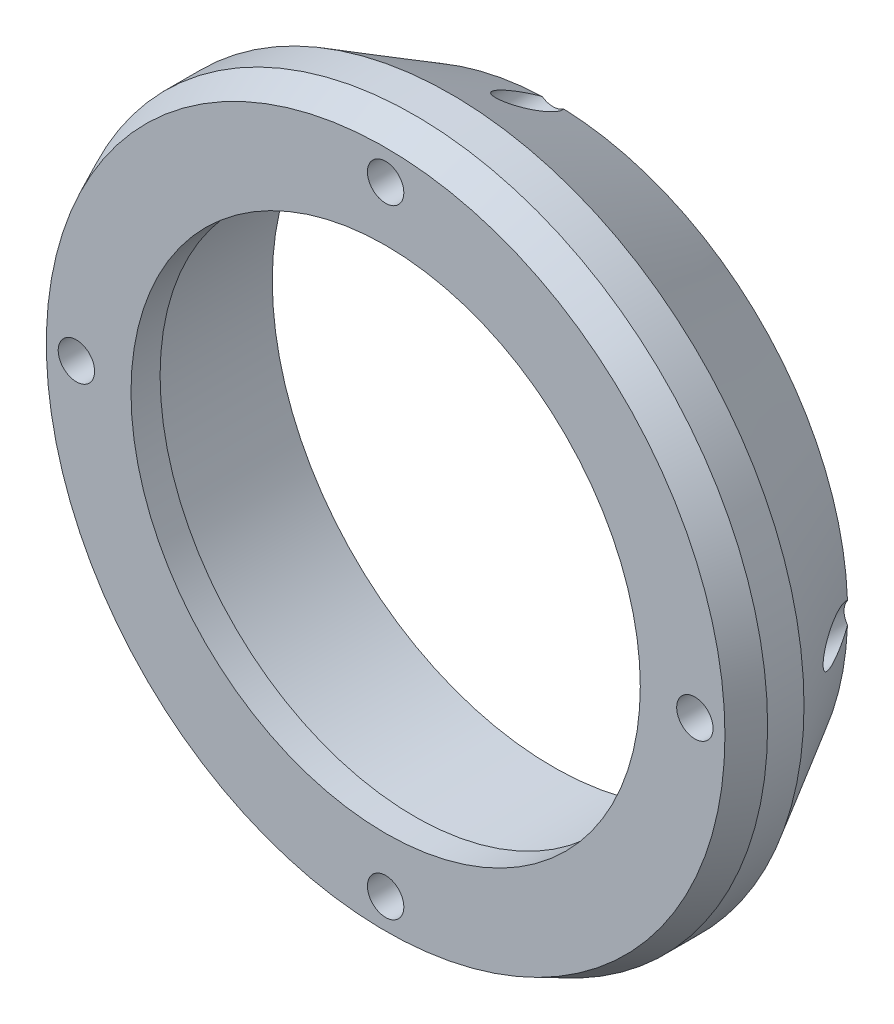
ISO-10303-21;
HEADER;
FILE_DESCRIPTION(('STEP AP214'),'2;1');
FILE_NAME('part.step','',(''),(''),'','','');
FILE_SCHEMA(('AUTOMOTIVE_DESIGN { 1 0 10303 214 1 1 1 1 }'));
ENDSEC;
DATA;
#1=APPLICATION_CONTEXT('core data for automotive mechanical design processes');
#2=APPLICATION_PROTOCOL_DEFINITION('international standard','automotive_design',2000,#1);
#3=PRODUCT_CONTEXT('',#1,'mechanical');
#4=PRODUCT('Part','Part','',(#3));
#5=PRODUCT_RELATED_PRODUCT_CATEGORY('part','',(#4));
#6=PRODUCT_DEFINITION_FORMATION('','',#4);
#7=PRODUCT_DEFINITION_CONTEXT('part definition',#1,'design');
#8=PRODUCT_DEFINITION('design','',#6,#7);
#9=PRODUCT_DEFINITION_SHAPE('','',#8);
#10=(LENGTH_UNIT() NAMED_UNIT(*) SI_UNIT(.MILLI.,.METRE.));
#11=(NAMED_UNIT(*) PLANE_ANGLE_UNIT() SI_UNIT($,.RADIAN.));
#12=(NAMED_UNIT(*) SI_UNIT($,.STERADIAN.) SOLID_ANGLE_UNIT());
#13=UNCERTAINTY_MEASURE_WITH_UNIT(LENGTH_MEASURE(1.E-05),#10,'distance_accuracy_value','');
#14=(GEOMETRIC_REPRESENTATION_CONTEXT(3) GLOBAL_UNCERTAINTY_ASSIGNED_CONTEXT((#13)) GLOBAL_UNIT_ASSIGNED_CONTEXT((#10,
#11,#12)) REPRESENTATION_CONTEXT('',''));
#15=CARTESIAN_POINT('',(0.,0.,0.));
#16=DIRECTION('',(0.,0.,1.));
#17=DIRECTION('',(1.,0.,0.));
#18=AXIS2_PLACEMENT_3D('',#15,#16,#17);
#19=CARTESIAN_POINT('',(0.,0.,29.21));
#20=DIRECTION('',(0.,0.,-1.));
#21=DIRECTION('',(-1.,0.,0.));
#22=AXIS2_PLACEMENT_3D('',#19,#20,#21);
#23=CYLINDRICAL_SURFACE('',#22,44.45);
#24=CARTESIAN_POINT('',(0.,0.,29.21));
#25=DIRECTION('',(0.,0.,1.));
#26=DIRECTION('',(1.,0.,0.));
#27=AXIS2_PLACEMENT_3D('',#24,#25,#26);
#28=CIRCLE('',#27,44.45);
#29=CARTESIAN_POINT('',(44.45,0.,29.21));
#30=VERTEX_POINT('',#29);
#31=EDGE_CURVE('E100',#30,#30,#28,.T.);
#32=ORIENTED_EDGE('',*,*,#31,.T.);
#33=EDGE_LOOP('',(#32));
#34=FACE_BOUND('',#33,.T.);
#35=CARTESIAN_POINT('',(0.,0.,24.13));
#36=DIRECTION('',(0.,0.,-1.));
#37=DIRECTION('',(-1.,0.,0.));
#38=AXIS2_PLACEMENT_3D('',#35,#36,#37);
#39=CIRCLE('',#38,44.45);
#40=CARTESIAN_POINT('',(-44.45,0.,24.13));
#41=VERTEX_POINT('',#40);
#42=EDGE_CURVE('E261',#41,#41,#39,.T.);
#43=ORIENTED_EDGE('',*,*,#42,.T.);
#44=EDGE_LOOP('',(#43));
#45=FACE_BOUND('',#44,.T.);
#46=ADVANCED_FACE('F33',(#34,#45),#23,.F.);
#47=CARTESIAN_POINT('',(0.,0.,29.21));
#48=DIRECTION('',(0.,0.,1.));
#49=DIRECTION('',(1.,0.,0.));
#50=AXIS2_PLACEMENT_3D('',#47,#48,#49);
#51=PLANE('',#50);
#52=CARTESIAN_POINT('',(0.,0.,29.21));
#53=DIRECTION('',(0.,0.,1.));
#54=DIRECTION('',(1.,0.,0.));
#55=AXIS2_PLACEMENT_3D('',#52,#53,#54);
#56=CIRCLE('',#55,59.2261570965728);
#57=CARTESIAN_POINT('',(59.2261570965728,0.,29.21));
#58=VERTEX_POINT('',#57);
#59=EDGE_CURVE('E41',#58,#58,#56,.T.);
#60=ORIENTED_EDGE('',*,*,#59,.T.);
#61=EDGE_LOOP('',(#60));
#62=FACE_BOUND('',#61,.T.);
#63=CARTESIAN_POINT('',(-53.975,5.66213859036841E-13,29.21));
#64=DIRECTION('',(0.,0.,1.));
#65=DIRECTION('',(1.,0.,0.));
#66=AXIS2_PLACEMENT_3D('',#63,#64,#65);
#67=CIRCLE('',#66,3.17499999999999);
#68=CARTESIAN_POINT('',(-50.8,5.66213859036841E-13,29.21));
#69=VERTEX_POINT('',#68);
#70=EDGE_CURVE('E88',#69,#69,#67,.T.);
#71=ORIENTED_EDGE('',*,*,#70,.F.);
#72=EDGE_LOOP('',(#71));
#73=FACE_BOUND('',#72,.T.);
#74=CARTESIAN_POINT('',(-3.77761044620962E-13,-53.975,29.21));
#75=DIRECTION('',(0.,0.,1.));
#76=DIRECTION('',(1.,0.,0.));
#77=AXIS2_PLACEMENT_3D('',#74,#75,#76);
#78=CIRCLE('',#77,3.17499999999999);
#79=CARTESIAN_POINT('',(3.17499999999961,-53.975,29.21));
#80=VERTEX_POINT('',#79);
#81=EDGE_CURVE('E87',#80,#80,#78,.T.);
#82=ORIENTED_EDGE('',*,*,#81,.F.);
#83=EDGE_LOOP('',(#82));
#84=FACE_BOUND('',#83,.T.);
#85=CARTESIAN_POINT('',(53.975,-1.89308230205083E-13,29.21));
#86=DIRECTION('',(0.,0.,1.));
#87=DIRECTION('',(1.,0.,0.));
#88=AXIS2_PLACEMENT_3D('',#85,#86,#87);
#89=CIRCLE('',#88,3.17499999999999);
#90=CARTESIAN_POINT('',(57.15,-1.89308230205083E-13,29.21));
#91=VERTEX_POINT('',#90);
#92=EDGE_CURVE('E254',#91,#91,#89,.T.);
#93=ORIENTED_EDGE('',*,*,#92,.F.);
#94=EDGE_LOOP('',(#93));
#95=FACE_BOUND('',#94,.T.);
#96=CARTESIAN_POINT('',(0.,53.975,29.21));
#97=DIRECTION('',(0.,0.,1.));
#98=DIRECTION('',(1.,0.,0.));
#99=AXIS2_PLACEMENT_3D('',#96,#97,#98);
#100=CIRCLE('',#99,3.17499999999999);
#101=CARTESIAN_POINT('',(3.17499999999999,53.975,29.21));
#102=VERTEX_POINT('',#101);
#103=EDGE_CURVE('E258',#102,#102,#100,.T.);
#104=ORIENTED_EDGE('',*,*,#103,.F.);
#105=EDGE_LOOP('',(#104));
#106=FACE_BOUND('',#105,.T.);
#107=ORIENTED_EDGE('',*,*,#31,.F.);
#108=EDGE_LOOP('',(#107));
#109=FACE_BOUND('',#108,.T.);
#110=ADVANCED_FACE('F154',(#62,#73,#84,#95,#106,#109),#51,.T.);
#111=CARTESIAN_POINT('',(0.,0.,0.));
#112=DIRECTION('',(0.,0.,1.));
#113=DIRECTION('',(1.,0.,0.));
#114=AXIS2_PLACEMENT_3D('',#111,#112,#113);
#115=PLANE('',#114);
#116=CARTESIAN_POINT('',(0.,0.,0.));
#117=DIRECTION('',(0.,0.,1.));
#118=DIRECTION('',(1.,0.,0.));
#119=AXIS2_PLACEMENT_3D('',#116,#117,#118);
#120=CIRCLE('',#119,51.4349999999999);
#121=CARTESIAN_POINT('',(-1.85933246267256,-51.401382352941,0.));
#122=VERTEX_POINT('',#121);
#123=CARTESIAN_POINT('',(-51.4013823529411,-1.85933246267167,0.));
#124=VERTEX_POINT('',#123);
#125=EDGE_CURVE('E86',#122,#124,#120,.F.);
#126=ORIENTED_EDGE('',*,*,#125,.T.);
#127=CARTESIAN_POINT('',(-53.975,5.66213859036841E-13,0.));
#128=DIRECTION('',(0.,0.,1.));
#129=DIRECTION('',(1.,0.,0.));
#130=AXIS2_PLACEMENT_3D('',#127,#128,#129);
#131=CIRCLE('',#130,3.17499999999999);
#132=CARTESIAN_POINT('',(-51.401382352941,1.85933246267273,0.));
#133=VERTEX_POINT('',#132);
#134=EDGE_CURVE('E47',#124,#133,#131,.T.);
#135=ORIENTED_EDGE('',*,*,#134,.T.);
#136=CARTESIAN_POINT('',(-1.85933246267221,51.4013823529411,0.));
#137=VERTEX_POINT('',#136);
#138=EDGE_CURVE('E84',#133,#137,#120,.F.);
#139=ORIENTED_EDGE('',*,*,#138,.T.);
#140=CARTESIAN_POINT('',(0.,53.975,0.));
#141=DIRECTION('',(0.,0.,1.));
#142=DIRECTION('',(1.,0.,0.));
#143=AXIS2_PLACEMENT_3D('',#140,#141,#142);
#144=CIRCLE('',#143,3.17499999999999);
#145=CARTESIAN_POINT('',(1.85933246267219,51.4013823529411,0.));
#146=VERTEX_POINT('',#145);
#147=EDGE_CURVE('E270',#137,#146,#144,.T.);
#148=ORIENTED_EDGE('',*,*,#147,.T.);
#149=CARTESIAN_POINT('',(51.4013823529411,1.85933246267203,0.));
#150=VERTEX_POINT('',#149);
#151=EDGE_CURVE('E97',#146,#150,#120,.F.);
#152=ORIENTED_EDGE('',*,*,#151,.T.);
#153=CARTESIAN_POINT('',(53.975,-1.89308230205083E-13,0.));
#154=DIRECTION('',(0.,0.,1.));
#155=DIRECTION('',(1.,0.,0.));
#156=AXIS2_PLACEMENT_3D('',#153,#154,#155);
#157=CIRCLE('',#156,3.17499999999999);
#158=CARTESIAN_POINT('',(51.401382352941,-1.85933246267237,0.));
#159=VERTEX_POINT('',#158);
#160=EDGE_CURVE('E108',#150,#159,#157,.T.);
#161=ORIENTED_EDGE('',*,*,#160,.T.);
#162=CARTESIAN_POINT('',(1.85933246267185,-51.4013823529411,0.));
#163=VERTEX_POINT('',#162);
#164=EDGE_CURVE('E98',#159,#163,#120,.F.);
#165=ORIENTED_EDGE('',*,*,#164,.T.);
#166=CARTESIAN_POINT('',(-3.77761044620962E-13,-53.975,0.));
#167=DIRECTION('',(0.,0.,1.));
#168=DIRECTION('',(1.,0.,0.));
#169=AXIS2_PLACEMENT_3D('',#166,#167,#168);
#170=CIRCLE('',#169,3.17499999999999);
#171=EDGE_CURVE('E54',#163,#122,#170,.T.);
#172=ORIENTED_EDGE('',*,*,#171,.T.);
#173=EDGE_LOOP('',(#126,#135,#139,#148,#152,#161,#165,#172));
#174=FACE_BOUND('',#173,.T.);
#175=CARTESIAN_POINT('',(0.,0.,0.));
#176=DIRECTION('',(0.,0.,-1.));
#177=DIRECTION('',(-1.,0.,0.));
#178=AXIS2_PLACEMENT_3D('',#175,#176,#177);
#179=CIRCLE('',#178,49.);
#180=CARTESIAN_POINT('',(-49.,0.,0.));
#181=VERTEX_POINT('',#180);
#182=EDGE_CURVE('E267',#181,#181,#179,.T.);
#183=ORIENTED_EDGE('',*,*,#182,.F.);
#184=EDGE_LOOP('',(#183));
#185=FACE_BOUND('',#184,.T.);
#186=ADVANCED_FACE('F81',(#174,#185),#115,.F.);
#187=CARTESIAN_POINT('',(0.,0.,29.21));
#188=DIRECTION('',(0.,0.,-1.));
#189=DIRECTION('',(-1.,0.,0.));
#190=AXIS2_PLACEMENT_3D('',#187,#188,#189);
#191=CYLINDRICAL_SURFACE('',#190,61.595);
#192=CARTESIAN_POINT('',(0.,0.,24.1300000000003));
#193=DIRECTION('',(0.,0.,1.));
#194=DIRECTION('',(1.,0.,0.));
#195=AXIS2_PLACEMENT_3D('',#192,#193,#194);
#196=CIRCLE('',#195,61.595);
#197=CARTESIAN_POINT('',(61.595,0.,24.1300000000003));
#198=VERTEX_POINT('',#197);
#199=EDGE_CURVE('E11',#198,#198,#196,.F.);
#200=ORIENTED_EDGE('',*,*,#199,.T.);
#201=EDGE_LOOP('',(#200));
#202=FACE_BOUND('',#201,.T.);
#203=CARTESIAN_POINT('',(0.,0.,17.7800000000003));
#204=DIRECTION('',(0.,0.,1.));
#205=DIRECTION('',(1.,0.,0.));
#206=AXIS2_PLACEMENT_3D('',#203,#204,#205);
#207=CIRCLE('',#206,61.595);
#208=CARTESIAN_POINT('',(61.595,0.,17.7800000000003));
#209=VERTEX_POINT('',#208);
#210=EDGE_CURVE('E95',#209,#209,#207,.T.);
#211=ORIENTED_EDGE('',*,*,#210,.T.);
#212=EDGE_LOOP('',(#211));
#213=FACE_BOUND('',#212,.T.);
#214=ADVANCED_FACE('F150',(#202,#213),#191,.T.);
#215=CARTESIAN_POINT('',(0.,0.,24.13));
#216=DIRECTION('',(0.,0.,-1.));
#217=DIRECTION('',(-1.,0.,0.));
#218=AXIS2_PLACEMENT_3D('',#215,#216,#217);
#219=CYLINDRICAL_SURFACE('',#218,49.);
#220=CARTESIAN_POINT('',(0.,0.,24.13));
#221=DIRECTION('',(0.,0.,-1.));
#222=DIRECTION('',(-1.,0.,0.));
#223=AXIS2_PLACEMENT_3D('',#220,#221,#222);
#224=CIRCLE('',#223,49.);
#225=CARTESIAN_POINT('',(-49.,0.,24.13));
#226=VERTEX_POINT('',#225);
#227=EDGE_CURVE('E264',#226,#226,#224,.T.);
#228=ORIENTED_EDGE('',*,*,#227,.F.);
#229=EDGE_LOOP('',(#228));
#230=FACE_BOUND('',#229,.T.);
#231=ORIENTED_EDGE('',*,*,#182,.T.);
#232=EDGE_LOOP('',(#231));
#233=FACE_BOUND('',#232,.T.);
#234=ADVANCED_FACE('F146',(#230,#233),#219,.F.);
#235=CARTESIAN_POINT('',(0.,0.,24.13));
#236=DIRECTION('',(0.,0.,-1.));
#237=DIRECTION('',(-1.,0.,0.));
#238=AXIS2_PLACEMENT_3D('',#235,#236,#237);
#239=PLANE('',#238);
#240=ORIENTED_EDGE('',*,*,#42,.F.);
#241=EDGE_LOOP('',(#240));
#242=FACE_BOUND('',#241,.T.);
#243=ORIENTED_EDGE('',*,*,#227,.T.);
#244=EDGE_LOOP('',(#243));
#245=FACE_BOUND('',#244,.T.);
#246=ADVANCED_FACE('F140',(#242,#245),#239,.T.);
#247=CARTESIAN_POINT('',(0.,0.,17.7800000000003));
#248=DIRECTION('',(0.,0.,1.));
#249=DIRECTION('',(1.,0.,0.));
#250=AXIS2_PLACEMENT_3D('',#247,#248,#249);
#251=CONICAL_SURFACE('',#250,61.595,0.519146114246522);
#252=CARTESIAN_POINT('',(-51.4012734454991,-1.85918170780977,-0.000199999999990098));
#253=CARTESIAN_POINT('',(-51.4384121362222,-1.91056861669642,0.0680029835427202));
#254=CARTESIAN_POINT('',(-51.4762639067181,-1.95975022674029,0.137436785456059));
#255=CARTESIAN_POINT('',(-51.5531593688588,-2.05402912522042,0.278323392027791));
#256=CARTESIAN_POINT('',(-51.5922023744235,-2.09912870743032,0.349775032830859));
#257=CARTESIAN_POINT('',(-51.6711892842854,-2.1855185721752,0.494151283747688));
#258=CARTESIAN_POINT('',(-51.7111306810145,-2.226818133023,0.567071745992356));
#259=CARTESIAN_POINT('',(-51.7918636446663,-2.30602209511741,0.714283575441759));
#260=CARTESIAN_POINT('',(-51.8326553504441,-2.34392593640469,0.788575166320671));
#261=CARTESIAN_POINT('',(-51.9555675797664,-2.4524334516724,1.012148738071));
#262=CARTESIAN_POINT('',(-52.03875856832,-2.51840531700512,1.16310463643481));
#263=CARTESIAN_POINT('',(-52.2073500363776,-2.63947104061149,1.46824961064455));
#264=CARTESIAN_POINT('',(-52.2927524752604,-2.69455485100364,1.62244152901958));
#265=CARTESIAN_POINT('',(-52.4549568372909,-2.78887263305361,1.91454764737455));
#266=CARTESIAN_POINT('',(-52.5315706058049,-2.829213212547,2.0522114966636));
#267=CARTESIAN_POINT('',(-52.6858718373725,-2.90276979486579,2.32884143659898));
#268=CARTESIAN_POINT('',(-52.7635594426743,-2.93598484397576,2.46780769897189));
#269=CARTESIAN_POINT('',(-52.9979722933121,-3.02557182883492,2.88616902104663));
#270=CARTESIAN_POINT('',(-53.1560407310288,-3.0718817235003,3.16701429086537));
#271=CARTESIAN_POINT('',(-53.4756032573726,-3.13975560528501,3.73221147218389));
#272=CARTESIAN_POINT('',(-53.6371134020172,-3.16114776332888,4.01657422423791));
#273=CARTESIAN_POINT('',(-53.9615382977486,-3.17912465760631,4.58518458691315));
#274=CARTESIAN_POINT('',(-54.1244525179476,-3.17571839177672,4.86943220187649));
#275=CARTESIAN_POINT('',(-54.4163925231944,-3.14682877163892,5.37652786016643));
#276=CARTESIAN_POINT('',(-54.5453335785844,-3.12614322148215,5.59970631134039));
#277=CARTESIAN_POINT('',(-54.8029807491155,-3.06798440444611,6.04411051686884));
#278=CARTESIAN_POINT('',(-54.9316868094149,-3.03050762362151,6.26533585260303));
#279=CARTESIAN_POINT('',(-55.1873177297869,-2.93756743447512,6.70323274742113));
#280=CARTESIAN_POINT('',(-55.3142486458057,-2.88221346437682,6.91992368247239));
#281=CARTESIAN_POINT('',(-55.5659718997606,-2.75128523080133,7.34824470596231));
#282=CARTESIAN_POINT('',(-55.6907658612755,-2.67572711553828,7.55987868966633));
#283=CARTESIAN_POINT('',(-55.9175712364169,-2.5146117651276,7.94329991004899));
#284=CARTESIAN_POINT('',(-56.0201091981879,-2.4324334566686,8.11616823970274));
#285=CARTESIAN_POINT('',(-56.1708147802292,-2.29426824457675,8.36960068165211));
#286=CARTESIAN_POINT('',(-56.2206100058125,-2.24564070800221,8.45322847979494));
#287=CARTESIAN_POINT('',(-56.3187976520908,-2.14296241226673,8.61792431529108));
#288=CARTESIAN_POINT('',(-56.3671904658112,-2.08891319185118,8.69899307039539));
#289=CARTESIAN_POINT('',(-56.4628027797775,-1.97411115605911,8.85897496120158));
#290=CARTESIAN_POINT('',(-56.5099989741494,-1.91328060234725,8.93784659344392));
#291=CARTESIAN_POINT('',(-56.6020168738817,-1.78483951319119,9.09144695714325));
#292=CARTESIAN_POINT('',(-56.6468376982447,-1.71722648873218,9.16617415194727));
#293=CARTESIAN_POINT('',(-56.7331420943355,-1.57485789274905,9.30991278029167));
#294=CARTESIAN_POINT('',(-56.7746390307291,-1.50013387460412,9.37894714044969));
#295=CARTESIAN_POINT('',(-56.8534329356122,-1.34275176520972,9.50990499587958));
#296=CARTESIAN_POINT('',(-56.890734885791,-1.26010330538581,9.57183692729244));
#297=CARTESIAN_POINT('',(-56.9596891879168,-1.08670216693173,9.68622868917949));
#298=CARTESIAN_POINT('',(-56.9913622463157,-0.99598111451323,9.7387232446285));
#299=CARTESIAN_POINT('',(-57.0474726556805,-0.806403294877354,9.83166213576627));
#300=CARTESIAN_POINT('',(-57.0719141430297,-0.707551220037359,9.87211336019809));
#301=CARTESIAN_POINT('',(-57.1118416708857,-0.501906973729896,9.93816847557352));
#302=CARTESIAN_POINT('',(-57.1272279219748,-0.39504044488242,9.9636069328159));
#303=CARTESIAN_POINT('',(-57.1469020240657,-0.177568107126635,9.99613104571709));
#304=CARTESIAN_POINT('',(-57.1512032055567,-0.0669669517294094,10.0032387452652));
#305=CARTESIAN_POINT('',(-57.1483907266993,0.139992098956218,9.99859012677025));
#306=CARTESIAN_POINT('',(-57.1426167717819,0.236427687813688,9.98904779401596));
#307=CARTESIAN_POINT('',(-57.1227342996212,0.426022962131321,9.9561770266579));
#308=CARTESIAN_POINT('',(-57.1086206444481,0.519180590583517,9.93284009346128));
#309=CARTESIAN_POINT('',(-57.0686232127139,0.723600343286238,9.86666840382554));
#310=CARTESIAN_POINT('',(-57.0406390673385,0.833311431573944,9.82035139335632));
#311=CARTESIAN_POINT('',(-56.9759588359173,1.04255905773684,9.71319820148417));
#312=CARTESIAN_POINT('',(-56.9392463924249,1.14207598385168,9.65233475789595));
#313=CARTESIAN_POINT('',(-56.8381399438395,1.38123431993416,9.48453085970768));
#314=CARTESIAN_POINT('',(-56.7694352693537,1.51390994960637,9.37034497978659));
#315=CARTESIAN_POINT('',(-56.6228280763273,1.7578281141449,9.12619900107026));
#316=CARTESIAN_POINT('',(-56.544902267377,1.86901442522105,8.99619893515521));
#317=CARTESIAN_POINT('',(-56.3914450451556,2.06278192692648,8.73964391836011));
#318=CARTESIAN_POINT('',(-56.3164630740954,2.1471163338063,8.61406091047468));
#319=CARTESIAN_POINT('',(-56.1632852789666,2.30303870691801,8.35699637626607));
#320=CARTESIAN_POINT('',(-56.0850869539895,2.37461651437208,8.22551025235658));
#321=CARTESIAN_POINT('',(-55.926444842818,2.50661892941384,7.95820716191345));
#322=CARTESIAN_POINT('',(-55.8459988755197,2.56703223735914,7.82238596907109));
#323=CARTESIAN_POINT('',(-55.6835812535593,2.67788016433974,7.54758144314041));
#324=CARTESIAN_POINT('',(-55.6016090772187,2.72831130018995,7.40859702507015));
#325=CARTESIAN_POINT('',(-55.4449612461771,2.81549998559037,7.14241981498062));
#326=CARTESIAN_POINT('',(-55.3703830520645,2.8531234428919,7.01545070353601));
#327=CARTESIAN_POINT('',(-55.2206510577268,2.92160069159828,6.76002544541514));
#328=CARTESIAN_POINT('',(-55.145497173706,2.95245347733467,6.63156908081169));
#329=CARTESIAN_POINT('',(-54.9194029198935,3.03555108207837,6.2443384536329));
#330=CARTESIAN_POINT('',(-54.7678967972869,3.07829899344084,5.98381621956777));
#331=CARTESIAN_POINT('',(-54.463997188476,3.14096527918297,5.45908693740209));
#332=CARTESIAN_POINT('',(-54.3116027726009,3.16078027667976,5.19486859603467));
#333=CARTESIAN_POINT('',(-54.0075136474927,3.17848254122352,4.66543152667179));
#334=CARTESIAN_POINT('',(-53.8558187052062,3.17637773347293,4.40021319489462));
#335=CARTESIAN_POINT('',(-53.544412424793,3.14978578667028,3.85345855024754));
#336=CARTESIAN_POINT('',(-53.3847922545661,3.12390871324655,3.57193781020755));
#337=CARTESIAN_POINT('',(-53.0679508504782,3.04704922256716,3.01060877547715));
#338=CARTESIAN_POINT('',(-52.9107313665664,2.99604931615246,2.73080181140402));
#339=CARTESIAN_POINT('',(-52.6784165688326,2.89938349888511,2.31549396606206));
#340=CARTESIAN_POINT('',(-52.6018794493277,2.86399159523391,2.17836083543838));
#341=CARTESIAN_POINT('',(-52.4499361760858,2.78605507084172,1.90551851539319));
#342=CARTESIAN_POINT('',(-52.3745298401051,2.74351161647852,1.76980909760043));
#343=CARTESIAN_POINT('',(-52.2251887123017,2.65075517637516,1.50044896623186));
#344=CARTESIAN_POINT('',(-52.1512521296201,2.60055226518874,1.36679579861773));
#345=CARTESIAN_POINT('',(-52.005110172032,2.49167838713458,1.10204858942656));
#346=CARTESIAN_POINT('',(-51.93290441186,2.43300932555412,0.970953979567826));
#347=CARTESIAN_POINT('',(-51.7816647260359,2.29814011362885,0.695786637773106));
#348=CARTESIAN_POINT('',(-51.7029213370148,2.22066138970114,0.55216794373081));
#349=CARTESIAN_POINT('',(-51.5875431776276,2.09378870163847,0.341250207110132));
#350=CARTESIAN_POINT('',(-51.5494731364568,2.04963186547842,0.271573279431611));
#351=CARTESIAN_POINT('',(-51.4744666580996,1.95741578002097,0.134139848529993));
#352=CARTESIAN_POINT('',(-51.4375310414108,1.90935379375611,0.0663847378923452));
#353=CARTESIAN_POINT('',(-51.4012734454993,1.8591817078112,-0.000199999999525845));
#354=B_SPLINE_CURVE_WITH_KNOTS('',3,(#252,#253,#254,#255,#256,#257,#258,#259,#260,#261,#262,
#263,#264,#265,#266,#267,#268,#269,#270,#271,#272,#273,#274,#275,#276,#277,#278,#279,#280,#281,
#282,#283,#284,#285,#286,#287,#288,#289,#290,#291,#292,#293,#294,#295,#296,#297,#298,#299,#300,
#301,#302,#303,#304,#305,#306,#307,#308,#309,#310,#311,#312,#313,#314,#315,#316,#317,#318,#319,
#320,#321,#322,#323,#324,#325,#326,#327,#328,#329,#330,#331,#332,#333,#334,#335,#336,#337,#338,
#339,#340,#341,#342,#343,#344,#345,#346,#347,#348,#349,#350,#351,#352,#353),.UNSPECIFIED.,.F.,
.F.,(4,2,2,2,2,2,2,2,2,2,2,2,2,2,2,2,2,2,2,2,2,2,2,2,2,2,2,2,2,2,2,2,2,2,2,2,2,2,2,2,2,2,2,2,2,
2,2,2,2,2,4),(0.,0.279281018412903,0.55840411605638,0.836826528833475,1.11529476970531,
1.66849077430098,2.22219492842348,2.70990302857099,3.19767636525656,4.17326675513999,
5.15554557552175,6.13746800058547,6.91271060085228,7.68811551402531,8.45886087758605,
9.22899205276928,9.87943567898986,10.2056998240974,10.5318716317313,10.8622668089502,
11.1927836804704,11.5218968706047,11.8506150058455,12.1780976921564,12.5053926980412,
12.8362300731984,13.1666694096868,13.4564406993172,13.7463906979067,14.1113510546227,
14.4770008404167,15.0379872051104,15.6004220119342,16.1062047516642,16.6123884913757,
17.1190817693349,17.6259515426615,18.081725537018,18.5375671831224,19.4496590164941,
20.365846553173,21.2817028497033,22.25476954847,23.2285146030375,23.7113326409012,
24.1940720101169,24.6761818162613,25.1581832934438,25.701109259773,25.9735662576275,
26.2462158849297),.UNSPECIFIED.);
#355=EDGE_CURVE('E71',#124,#133,#354,.T.);
#356=ORIENTED_EDGE('',*,*,#355,.F.);
#357=ORIENTED_EDGE('',*,*,#125,.F.);
#358=CARTESIAN_POINT('',(1.8591817078103,-51.4012734454993,-0.00019999999952085));
#359=CARTESIAN_POINT('',(1.91056861669695,-51.4384121362225,0.0680029835432135));
#360=CARTESIAN_POINT('',(1.95975022674082,-51.4762639067183,0.137436785456574));
#361=CARTESIAN_POINT('',(2.05402912522096,-51.5531593688591,0.278323392028346));
#362=CARTESIAN_POINT('',(2.09912870743086,-51.5922023744238,0.349775032831434));
#363=CARTESIAN_POINT('',(2.18551857217574,-51.6711892842858,0.494151283748306));
#364=CARTESIAN_POINT('',(2.22681813302353,-51.7111306810149,0.567071745992997));
#365=CARTESIAN_POINT('',(2.30602209511795,-51.7918636446666,0.714283575442443));
#366=CARTESIAN_POINT('',(2.34392593640522,-51.8326553504445,0.788575166321374));
#367=CARTESIAN_POINT('',(2.45243345167293,-51.9555675797668,1.01214873807177));
#368=CARTESIAN_POINT('',(2.51840531700564,-52.0387585683205,1.16310463643562));
#369=CARTESIAN_POINT('',(2.639471040612,-52.2073500363781,1.46824961064544));
#370=CARTESIAN_POINT('',(2.69455485100414,-52.292752475261,1.62244152902052));
#371=CARTESIAN_POINT('',(2.78887263305409,-52.4549568372915,1.91454764737555));
#372=CARTESIAN_POINT('',(2.82921321254747,-52.5315706058054,2.05221149666462));
#373=CARTESIAN_POINT('',(2.90276979486624,-52.6858718373731,2.32884143660005));
#374=CARTESIAN_POINT('',(2.9359848439762,-52.7635594426749,2.46780769897298));
#375=CARTESIAN_POINT('',(3.02557182883532,-52.9979722933128,2.88616902104779));
#376=CARTESIAN_POINT('',(3.07188172350067,-53.1560407310294,3.16701429086658));
#377=CARTESIAN_POINT('',(3.13975560528531,-53.4756032573734,3.7322114721852));
#378=CARTESIAN_POINT('',(3.16114776332914,-53.6371134020179,4.01657422423926));
#379=CARTESIAN_POINT('',(3.1791246576065,-53.9615382977494,4.58518458691458));
#380=CARTESIAN_POINT('',(3.17571839177687,-54.1244525179485,4.86943220187795));
#381=CARTESIAN_POINT('',(3.146828771639,-54.4163925231952,5.37652786016784));
#382=CARTESIAN_POINT('',(3.1261432214822,-54.5453335785852,5.5997063113417));
#383=CARTESIAN_POINT('',(3.06798440444612,-54.8029807491162,6.04411051686995));
#384=CARTESIAN_POINT('',(3.03050762362151,-54.9316868094154,6.26533585260404));
#385=CARTESIAN_POINT('',(2.93756743447511,-55.1873177297874,6.70323274742195));
#386=CARTESIAN_POINT('',(2.88221346437681,-55.3142486458061,6.91992368247311));
#387=CARTESIAN_POINT('',(2.75128523080134,-55.5659718997609,7.34824470596284));
#388=CARTESIAN_POINT('',(2.67572711553832,-55.6907658612757,7.55987868966676));
#389=CARTESIAN_POINT('',(2.51461176512763,-55.9175712364171,7.94329991004937));
#390=CARTESIAN_POINT('',(2.43243345666859,-56.0201091981882,8.11616823970316));
#391=CARTESIAN_POINT('',(2.29426824457668,-56.1708147802294,8.36960068165259));
#392=CARTESIAN_POINT('',(2.24564070800211,-56.2206100058128,8.45322847979543));
#393=CARTESIAN_POINT('',(2.14296241226658,-56.3187976520911,8.61792431529161));
#394=CARTESIAN_POINT('',(2.088913191851,-56.3671904658115,8.69899307039593));
#395=CARTESIAN_POINT('',(1.97411115605888,-56.4628027797779,8.85897496120215));
#396=CARTESIAN_POINT('',(1.91328060234698,-56.5099989741498,8.93784659344451));
#397=CARTESIAN_POINT('',(1.78483951319086,-56.6020168738821,9.09144695714386));
#398=CARTESIAN_POINT('',(1.7172264887318,-56.646837698245,9.16617415194789));
#399=CARTESIAN_POINT('',(1.57485789274858,-56.7331420943359,9.3099127802923));
#400=CARTESIAN_POINT('',(1.50013387460361,-56.7746390307295,9.37894714045031));
#401=CARTESIAN_POINT('',(1.34275176520912,-56.8534329356126,9.5099049958802));
#402=CARTESIAN_POINT('',(1.26010330538515,-56.8907348857914,9.57183692729306));
#403=CARTESIAN_POINT('',(1.08670216693101,-56.9596891879171,9.68622868918004));
#404=CARTESIAN_POINT('',(0.995981114512516,-56.991362246316,9.738723244629));
#405=CARTESIAN_POINT('',(0.806403294876647,-57.0474726556807,9.83166213576666));
#406=CARTESIAN_POINT('',(0.707551220036659,-57.0719141430299,9.87211336019842));
#407=CARTESIAN_POINT('',(0.501906973729224,-57.1118416708859,9.93816847557374));
#408=CARTESIAN_POINT('',(0.39504044488177,-57.127227921975,9.96360693281608));
#409=CARTESIAN_POINT('',(0.177568107126037,-57.1469020240658,9.99613104571717));
#410=CARTESIAN_POINT('',(0.0669669517288433,-57.1512032055568,10.0032387452652));
#411=CARTESIAN_POINT('',(-0.139992098956728,-57.1483907266992,9.99859012677019));
#412=CARTESIAN_POINT('',(-0.236427687814174,-57.1426167717818,9.98904779401586));
#413=CARTESIAN_POINT('',(-0.426022962131756,-57.1227342996211,9.95617702665775));
#414=CARTESIAN_POINT('',(-0.519180590583923,-57.108620644448,9.93284009346111));
#415=CARTESIAN_POINT('',(-0.723600343286639,-57.0686232127138,9.86666840382531));
#416=CARTESIAN_POINT('',(-0.833311431574362,-57.0406390673383,9.82035139335604));
#417=CARTESIAN_POINT('',(-1.04255905773728,-56.9759588359171,9.71319820148379));
#418=CARTESIAN_POINT('',(-1.14207598385213,-56.9392463924246,9.65233475789553));
#419=CARTESIAN_POINT('',(-1.38123431993466,-56.8381399438391,9.48453085970712));
#420=CARTESIAN_POINT('',(-1.51390994960689,-56.7694352693534,9.37034497978595));
#421=CARTESIAN_POINT('',(-1.75782811414546,-56.6228280763268,9.12619900106943));
#422=CARTESIAN_POINT('',(-1.86901442522162,-56.5449022673765,8.99619893515428));
#423=CARTESIAN_POINT('',(-2.06278192692708,-56.3914450451549,8.73964391835899));
#424=CARTESIAN_POINT('',(-2.14711633380691,-56.3164630740946,8.61406091047345));
#425=CARTESIAN_POINT('',(-2.30303870691863,-56.1632852789657,8.35699637626464));
#426=CARTESIAN_POINT('',(-2.37461651437269,-56.0850869539886,8.22551025235505));
#427=CARTESIAN_POINT('',(-2.50661892941445,-55.926444842817,7.95820716191172));
#428=CARTESIAN_POINT('',(-2.56703223735974,-55.8459988755186,7.82238596906925));
#429=CARTESIAN_POINT('',(-2.67788016434031,-55.6835812535581,7.54758144313837));
#430=CARTESIAN_POINT('',(-2.72831130019051,-55.6016090772174,7.40859702506801));
#431=CARTESIAN_POINT('',(-2.81549998559089,-55.4449612461758,7.14241981497831));
#432=CARTESIAN_POINT('',(-2.85312344289239,-55.3703830520631,7.01545070353363));
#433=CARTESIAN_POINT('',(-2.92160069159872,-55.2206510577253,6.76002544541262));
#434=CARTESIAN_POINT('',(-2.95245347733507,-55.1454971737045,6.63156908080911));
#435=CARTESIAN_POINT('',(-3.03555108207868,-54.9194029198919,6.24433845363013));
#436=CARTESIAN_POINT('',(-3.07829899344109,-54.7678967972852,5.98381621956486));
#437=CARTESIAN_POINT('',(-3.14096527918306,-54.4639971884742,5.45908693739892));
#438=CARTESIAN_POINT('',(-3.16078027667977,-54.311602772599,5.19486859603138));
#439=CARTESIAN_POINT('',(-3.17848254122336,-54.0075136474907,4.66543152666825));
#440=CARTESIAN_POINT('',(-3.17637773347267,-53.8558187052041,4.40021319489095));
#441=CARTESIAN_POINT('',(-3.14978578666979,-53.5444124247907,3.85345855024364));
#442=CARTESIAN_POINT('',(-3.12390871324593,-53.3847922545639,3.57193781020355));
#443=CARTESIAN_POINT('',(-3.04704922256628,-53.0679508504759,3.01060877547296));
#444=CARTESIAN_POINT('',(-2.99604931615143,-52.910731366564,2.73080181139974));
#445=CARTESIAN_POINT('',(-2.89938349888382,-52.6784165688301,2.31549396605766));
#446=CARTESIAN_POINT('',(-2.86399159523253,-52.6018794493253,2.17836083543394));
#447=CARTESIAN_POINT('',(-2.78605507084016,-52.4499361760833,1.90551851538868));
#448=CARTESIAN_POINT('',(-2.74351161647687,-52.3745298401026,1.76980909759589));
#449=CARTESIAN_POINT('',(-2.6507551763733,-52.2251887122991,1.50044896622728));
#450=CARTESIAN_POINT('',(-2.60055226518677,-52.1512521296176,1.36679579861312));
#451=CARTESIAN_POINT('',(-2.49167838713237,-52.0051101720295,1.10204858942192));
#452=CARTESIAN_POINT('',(-2.43300932555178,-51.9329044118575,0.970953979563178));
#453=CARTESIAN_POINT('',(-2.29814011362659,-51.7816647260338,0.695786637769191));
#454=CARTESIAN_POINT('',(-2.22066138969914,-51.702921337013,0.552167943727616));
#455=CARTESIAN_POINT('',(-2.09378870163695,-51.5875431776264,0.341250207107991));
#456=CARTESIAN_POINT('',(-2.04963186547707,-51.5494731364558,0.271573279429817));
#457=CARTESIAN_POINT('',(-1.95741578002001,-51.474466658099,0.134139848528879));
#458=CARTESIAN_POINT('',(-1.90935379375536,-51.4375310414104,0.0663847378915636));
#459=CARTESIAN_POINT('',(-1.85918170781067,-51.401273445499,-0.000199999999984656));
#460=B_SPLINE_CURVE_WITH_KNOTS('',3,(#358,#359,#360,#361,#362,#363,#364,#365,#366,#367,#368,
#369,#370,#371,#372,#373,#374,#375,#376,#377,#378,#379,#380,#381,#382,#383,#384,#385,#386,#387,
#388,#389,#390,#391,#392,#393,#394,#395,#396,#397,#398,#399,#400,#401,#402,#403,#404,#405,#406,
#407,#408,#409,#410,#411,#412,#413,#414,#415,#416,#417,#418,#419,#420,#421,#422,#423,#424,#425,
#426,#427,#428,#429,#430,#431,#432,#433,#434,#435,#436,#437,#438,#439,#440,#441,#442,#443,#444,
#445,#446,#447,#448,#449,#450,#451,#452,#453,#454,#455,#456,#457,#458,#459),.UNSPECIFIED.,.F.,
.F.,(4,2,2,2,2,2,2,2,2,2,2,2,2,2,2,2,2,2,2,2,2,2,2,2,2,2,2,2,2,2,2,2,2,2,2,2,2,2,2,2,2,2,2,2,2,
2,2,2,2,2,4),(0.,0.279281018412969,0.55840411605651,0.836826528833671,1.11529476970557,
1.66849077430137,2.222194928424,2.70990302857159,3.19767636525722,4.1732667551408,
5.15554557552271,6.13746800058657,6.91271060085304,7.68811551402575,8.45886087758615,
9.22899205276905,9.8794356789898,10.2056998240975,10.5318716317315,10.8622668089504,
11.1927836804707,11.5218968706051,11.850615005846,12.1780976921568,12.5053926980415,
12.8362300731986,13.1666694096869,13.4564406993172,13.7463906979067,14.1113510546228,
14.477000840417,15.0379872051109,15.600422011935,16.1062047516654,16.6123884913771,
17.1190817693367,17.6259515426636,18.0817255370203,18.5375671831249,19.449659016497,
20.3658465531763,21.281702849707,22.2547695484741,23.228514603042,23.7113326409058,
24.1940720101217,24.6761818162663,25.158183293449,25.7011092597756,25.9735662576288,
26.2462158849297),.UNSPECIFIED.);
#461=EDGE_CURVE('E78',#163,#122,#460,.T.);
#462=ORIENTED_EDGE('',*,*,#461,.F.);
#463=ORIENTED_EDGE('',*,*,#164,.F.);
#464=CARTESIAN_POINT('',(51.4012734454993,1.85918170781048,-0.000199999999521266));
#465=CARTESIAN_POINT('',(51.4384121362225,1.91056861669713,0.0680029835432099));
#466=CARTESIAN_POINT('',(51.4762639067183,1.959750226741,0.137436785456569));
#467=CARTESIAN_POINT('',(51.5531593688591,2.05402912522114,0.278323392028342));
#468=CARTESIAN_POINT('',(51.5922023744238,2.09912870743104,0.349775032831432));
#469=CARTESIAN_POINT('',(51.6711892842858,2.18551857217592,0.494151283748303));
#470=CARTESIAN_POINT('',(51.7111306810148,2.22681813302371,0.567071745992993));
#471=CARTESIAN_POINT('',(51.7918636446666,2.30602209511813,0.714283575442438));
#472=CARTESIAN_POINT('',(51.8326553504445,2.34392593640541,0.788575166321371));
#473=CARTESIAN_POINT('',(51.9555675797668,2.45243345167311,1.01214873807176));
#474=CARTESIAN_POINT('',(52.0387585683205,2.51840531700583,1.16310463643561));
#475=CARTESIAN_POINT('',(52.2073500363781,2.63947104061219,1.46824961064544));
#476=CARTESIAN_POINT('',(52.2927524752609,2.69455485100433,1.62244152902052));
#477=CARTESIAN_POINT('',(52.4549568372915,2.78887263305428,1.91454764737556));
#478=CARTESIAN_POINT('',(52.5315706058054,2.82921321254766,2.05221149666463));
#479=CARTESIAN_POINT('',(52.685871837373,2.90276979486643,2.32884143660006));
#480=CARTESIAN_POINT('',(52.7635594426749,2.93598484397639,2.467807698973));
#481=CARTESIAN_POINT('',(52.9979722933128,3.02557182883551,2.8861690210478));
#482=CARTESIAN_POINT('',(53.1560407310294,3.07188172350086,3.1670142908666));
#483=CARTESIAN_POINT('',(53.4756032573734,3.1397556052855,3.73221147218521));
#484=CARTESIAN_POINT('',(53.6371134020179,3.16114776332933,4.01657422423928));
#485=CARTESIAN_POINT('',(53.9615382977494,3.17912465760669,4.58518458691461));
#486=CARTESIAN_POINT('',(54.1244525179485,3.17571839177706,4.86943220187798));
#487=CARTESIAN_POINT('',(54.4163925231952,3.14682877163919,5.37652786016787));
#488=CARTESIAN_POINT('',(54.5453335785852,3.12614322148239,5.59970631134173));
#489=CARTESIAN_POINT('',(54.8029807491162,3.06798440444631,6.04411051686997));
#490=CARTESIAN_POINT('',(54.9316868094154,3.0305076236217,6.26533585260405));
#491=CARTESIAN_POINT('',(55.1873177297874,2.9375674344753,6.70323274742196));
#492=CARTESIAN_POINT('',(55.3142486458061,2.882213464377,6.91992368247312));
#493=CARTESIAN_POINT('',(55.5659718997609,2.75128523080154,7.34824470596284));
#494=CARTESIAN_POINT('',(55.6907658612757,2.67572711553851,7.55987868966676));
#495=CARTESIAN_POINT('',(55.9175712364171,2.51461176512782,7.94329991004937));
#496=CARTESIAN_POINT('',(56.0201091981882,2.43243345666878,8.11616823970316));
#497=CARTESIAN_POINT('',(56.1708147802294,2.29426824457687,8.36960068165259));
#498=CARTESIAN_POINT('',(56.2206100058128,2.24564070800231,8.45322847979544));
#499=CARTESIAN_POINT('',(56.3187976520911,2.14296241226677,8.61792431529162));
#500=CARTESIAN_POINT('',(56.3671904658115,2.0889131918512,8.69899307039594));
#501=CARTESIAN_POINT('',(56.4628027797779,1.97411115605907,8.85897496120216));
#502=CARTESIAN_POINT('',(56.5099989741498,1.91328060234717,8.93784659344453));
#503=CARTESIAN_POINT('',(56.6020168738821,1.78483951319104,9.09144695714388));
#504=CARTESIAN_POINT('',(56.6468376982451,1.71722648873199,9.16617415194791));
#505=CARTESIAN_POINT('',(56.7331420943359,1.57485789274876,9.30991278029232));
#506=CARTESIAN_POINT('',(56.7746390307295,1.50013387460379,9.37894714045033));
#507=CARTESIAN_POINT('',(56.8534329356126,1.34275176520929,9.50990499588022));
#508=CARTESIAN_POINT('',(56.8907348857914,1.26010330538533,9.57183692729308));
#509=CARTESIAN_POINT('',(56.9596891879172,1.0867021669312,9.68622868918006));
#510=CARTESIAN_POINT('',(56.991362246316,0.9959811145127,9.73872324462902));
#511=CARTESIAN_POINT('',(57.0474726556807,0.806403294876831,9.83166213576667));
#512=CARTESIAN_POINT('',(57.0719141430299,0.707551220036844,9.87211336019844));
#513=CARTESIAN_POINT('',(57.1118416708859,0.501906973729409,9.93816847557375));
#514=CARTESIAN_POINT('',(57.127227921975,0.395040444881955,9.96360693281608));
#515=CARTESIAN_POINT('',(57.1469020240658,0.177568107126223,9.99613104571716));
#516=CARTESIAN_POINT('',(57.1512032055568,0.0669669517290296,10.0032387452652));
#517=CARTESIAN_POINT('',(57.1483907266992,-0.13999209895654,9.99859012677019));
#518=CARTESIAN_POINT('',(57.1426167717818,-0.236427687813986,9.98904779401587));
#519=CARTESIAN_POINT('',(57.1227342996211,-0.426022962131566,9.95617702665775));
#520=CARTESIAN_POINT('',(57.108620644448,-0.519180590583732,9.93284009346111));
#521=CARTESIAN_POINT('',(57.0686232127138,-0.723600343286446,9.8666684038253));
#522=CARTESIAN_POINT('',(57.0406390673383,-0.833311431574168,9.82035139335603));
#523=CARTESIAN_POINT('',(56.9759588359171,-1.04255905773709,9.71319820148379));
#524=CARTESIAN_POINT('',(56.9392463924246,-1.14207598385194,9.65233475789553));
#525=CARTESIAN_POINT('',(56.8381399438391,-1.38123431993448,9.48453085970712));
#526=CARTESIAN_POINT('',(56.7694352693534,-1.51390994960671,9.37034497978594));
#527=CARTESIAN_POINT('',(56.6228280763268,-1.75782811414528,9.12619900106941));
#528=CARTESIAN_POINT('',(56.5449022673765,-1.86901442522144,8.99619893515426));
#529=CARTESIAN_POINT('',(56.3914450451549,-2.0627819269269,8.73964391835896));
#530=CARTESIAN_POINT('',(56.3164630740946,-2.14711633380673,8.61406091047342));
#531=CARTESIAN_POINT('',(56.1632852789657,-2.30303870691845,8.35699637626461));
#532=CARTESIAN_POINT('',(56.0850869539886,-2.37461651437252,8.22551025235501));
#533=CARTESIAN_POINT('',(55.9264448428169,-2.50661892941427,7.95820716191168));
#534=CARTESIAN_POINT('',(55.8459988755186,-2.56703223735956,7.82238596906922));
#535=CARTESIAN_POINT('',(55.6835812535581,-2.67788016434013,7.54758144313833));
#536=CARTESIAN_POINT('',(55.6016090772174,-2.72831130019033,7.40859702506797));
#537=CARTESIAN_POINT('',(55.4449612461758,-2.81549998559071,7.14241981497827));
#538=CARTESIAN_POINT('',(55.3703830520631,-2.85312344289221,7.01545070353359));
#539=CARTESIAN_POINT('',(55.2206510577253,-2.92160069159854,6.76002544541258));
#540=CARTESIAN_POINT('',(55.1454971737045,-2.95245347733489,6.63156908080907));
#541=CARTESIAN_POINT('',(54.9194029198918,-3.0355510820785,6.24433845363007));
#542=CARTESIAN_POINT('',(54.7678967972852,-3.0782989934409,5.98381621956481));
#543=CARTESIAN_POINT('',(54.4639971884741,-3.14096527918288,5.45908693739886));
#544=CARTESIAN_POINT('',(54.311602772599,-3.16078027667959,5.19486859603131));
#545=CARTESIAN_POINT('',(54.0075136474907,-3.17848254122317,4.66543152666818));
#546=CARTESIAN_POINT('',(53.8558187052041,-3.17637773347248,4.40021319489088));
#547=CARTESIAN_POINT('',(53.5444124247907,-3.1497857866696,3.85345855024357));
#548=CARTESIAN_POINT('',(53.3847922545638,-3.12390871324574,3.57193781020347));
#549=CARTESIAN_POINT('',(53.0679508504758,-3.04704922256608,3.01060877547288));
#550=CARTESIAN_POINT('',(52.910731366564,-2.99604931615123,2.73080181139966));
#551=CARTESIAN_POINT('',(52.6784165688301,-2.89938349888362,2.31549396605757));
#552=CARTESIAN_POINT('',(52.6018794493252,-2.86399159523233,2.17836083543385));
#553=CARTESIAN_POINT('',(52.4499361760833,-2.78605507083995,1.90551851538859));
#554=CARTESIAN_POINT('',(52.3745298401026,-2.74351161647666,1.7698090975958));
#555=CARTESIAN_POINT('',(52.2251887122991,-2.65075517637308,1.50044896622718));
#556=CARTESIAN_POINT('',(52.1512521296175,-2.60055226518655,1.36679579861302));
#557=CARTESIAN_POINT('',(52.0051101720294,-2.49167838713215,1.10204858942182));
#558=CARTESIAN_POINT('',(51.9329044118574,-2.43300932555156,0.970953979563077));
#559=CARTESIAN_POINT('',(51.7816647260338,-2.29814011362637,0.695786637769106));
#560=CARTESIAN_POINT('',(51.702921337013,-2.22066138969892,0.552167943727547));
#561=CARTESIAN_POINT('',(51.5875431776264,-2.09378870163674,0.341250207107946));
#562=CARTESIAN_POINT('',(51.5494731364558,-2.04963186547687,0.271573279429781));
#563=CARTESIAN_POINT('',(51.474466658099,-1.95741578001982,0.134139848528858));
#564=CARTESIAN_POINT('',(51.4375310414104,-1.90935379375517,0.0663847378915487));
#565=CARTESIAN_POINT('',(51.401273445499,-1.8591817078105,-0.000199999999994612));
#566=B_SPLINE_CURVE_WITH_KNOTS('',3,(#464,#465,#466,#467,#468,#469,#470,#471,#472,#473,#474,
#475,#476,#477,#478,#479,#480,#481,#482,#483,#484,#485,#486,#487,#488,#489,#490,#491,#492,#493,
#494,#495,#496,#497,#498,#499,#500,#501,#502,#503,#504,#505,#506,#507,#508,#509,#510,#511,#512,
#513,#514,#515,#516,#517,#518,#519,#520,#521,#522,#523,#524,#525,#526,#527,#528,#529,#530,#531,
#532,#533,#534,#535,#536,#537,#538,#539,#540,#541,#542,#543,#544,#545,#546,#547,#548,#549,#550,
#551,#552,#553,#554,#555,#556,#557,#558,#559,#560,#561,#562,#563,#564,#565),.UNSPECIFIED.,.F.,
.F.,(4,2,2,2,2,2,2,2,2,2,2,2,2,2,2,2,2,2,2,2,2,2,2,2,2,2,2,2,2,2,2,2,2,2,2,2,2,2,2,2,2,2,2,2,2,
2,2,2,2,2,4),(0.,0.279281018412965,0.558404116056508,0.836826528833668,1.11529476970557,
1.66849077430137,2.222194928424,2.7099030285716,3.19767636525724,4.17326675514083,
5.15554557552274,6.1374680005866,6.91271060085307,7.68811551402576,8.45886087758616,
9.22899205276905,9.87943567898981,10.2056998240975,10.5318716317315,10.8622668089505,
11.1927836804708,11.5218968706051,11.850615005846,12.1780976921569,12.5053926980415,
12.8362300731986,13.1666694096869,13.4564406993172,13.7463906979067,14.1113510546228,
14.477000840417,15.0379872051109,15.6004220119351,16.1062047516654,16.6123884913772,
17.1190817693367,17.6259515426636,18.0817255370203,18.5375671831249,19.4496590164971,
20.3658465531764,21.2817028497071,22.2547695484742,23.2285146030421,23.7113326409059,
24.1940720101218,24.6761818162664,25.1581832934491,25.7011092597757,25.9735662576288,
26.2462158849297),.UNSPECIFIED.);
#567=EDGE_CURVE('E105',#150,#159,#566,.T.);
#568=ORIENTED_EDGE('',*,*,#567,.F.);
#569=ORIENTED_EDGE('',*,*,#151,.F.);
#570=CARTESIAN_POINT('',(-1.85918170781031,51.401273445499,-0.000199999999990237));
#571=CARTESIAN_POINT('',(-1.91056861669695,51.4384121362222,0.0680029835427203));
#572=CARTESIAN_POINT('',(-1.95975022674082,51.4762639067181,0.137436785456057));
#573=CARTESIAN_POINT('',(-2.05402912522096,51.5531593688587,0.278323392027784));
#574=CARTESIAN_POINT('',(-2.09912870743087,51.5922023744235,0.34977503283085));
#575=CARTESIAN_POINT('',(-2.18551857217574,51.6711892842854,0.49415128374768));
#576=CARTESIAN_POINT('',(-2.22681813302354,51.7111306810145,0.56707174599235));
#577=CARTESIAN_POINT('',(-2.30602209511795,51.7918636446663,0.714283575441755));
#578=CARTESIAN_POINT('',(-2.34392593640523,51.8326553504441,0.788575166320666));
#579=CARTESIAN_POINT('',(-2.45243345167294,51.9555675797664,1.01214873807099));
#580=CARTESIAN_POINT('',(-2.51840531700566,52.03875856832,1.1631046364348));
#581=CARTESIAN_POINT('',(-2.63947104061203,52.2073500363776,1.46824961064454));
#582=CARTESIAN_POINT('',(-2.69455485100418,52.2927524752604,1.62244152901958));
#583=CARTESIAN_POINT('',(-2.78887263305415,52.4549568372909,1.91454764737455));
#584=CARTESIAN_POINT('',(-2.82921321254755,52.5315706058048,2.05221149666359));
#585=CARTESIAN_POINT('',(-2.90276979486634,52.6858718373724,2.32884143659896));
#586=CARTESIAN_POINT('',(-2.93598484397631,52.7635594426743,2.46780769897188));
#587=CARTESIAN_POINT('',(-3.02557182883548,52.9979722933121,2.8861690210466));
#588=CARTESIAN_POINT('',(-3.07188172350086,53.1560407310287,3.16701429086535));
#589=CARTESIAN_POINT('',(-3.13975560528557,53.4756032573726,3.73221147218387));
#590=CARTESIAN_POINT('',(-3.16114776332944,53.6371134020171,4.01657422423789));
#591=CARTESIAN_POINT('',(-3.17912465760688,53.9615382977486,4.58518458691313));
#592=CARTESIAN_POINT('',(-3.17571839177729,54.1244525179476,4.86943220187646));
#593=CARTESIAN_POINT('',(-3.14682877163949,54.4163925231944,5.37652786016641));
#594=CARTESIAN_POINT('',(-3.12614322148272,54.5453335785844,5.59970631134037));
#595=CARTESIAN_POINT('',(-3.06798440444669,54.8029807491155,6.04411051686882));
#596=CARTESIAN_POINT('',(-3.03050762362209,54.9316868094148,6.26533585260301));
#597=CARTESIAN_POINT('',(-2.9375674344757,55.1873177297869,6.70323274742112));
#598=CARTESIAN_POINT('',(-2.8822134643774,55.3142486458057,6.91992368247239));
#599=CARTESIAN_POINT('',(-2.75128523080191,55.5659718997606,7.3482447059623));
#600=CARTESIAN_POINT('',(-2.67572711553887,55.6907658612754,7.55987868966632));
#601=CARTESIAN_POINT('',(-2.51461176512819,55.9175712364168,7.94329991004899));
#602=CARTESIAN_POINT('',(-2.43243345666919,56.0201091981879,8.11616823970274));
#603=CARTESIAN_POINT('',(-2.29426824457735,56.1708147802291,8.3696006816521));
#604=CARTESIAN_POINT('',(-2.24564070800281,56.2206100058125,8.45322847979493));
#605=CARTESIAN_POINT('',(-2.14296241226732,56.3187976520907,8.61792431529107));
#606=CARTESIAN_POINT('',(-2.08891319185177,56.3671904658112,8.69899307039538));
#607=CARTESIAN_POINT('',(-1.97411115605971,56.4628027797775,8.85897496120157));
#608=CARTESIAN_POINT('',(-1.91328060234785,56.5099989741494,8.93784659344392));
#609=CARTESIAN_POINT('',(-1.7848395131918,56.6020168738817,9.09144695714324));
#610=CARTESIAN_POINT('',(-1.71722648873278,56.6468376982447,9.16617415194726));
#611=CARTESIAN_POINT('',(-1.57485789274964,56.7331420943355,9.30991278029166));
#612=CARTESIAN_POINT('',(-1.50013387460472,56.7746390307291,9.37894714044967));
#613=CARTESIAN_POINT('',(-1.34275176521033,56.8534329356122,9.50990499587957));
#614=CARTESIAN_POINT('',(-1.26010330538643,56.890734885791,9.57183692729244));
#615=CARTESIAN_POINT('',(-1.08670216693235,56.9596891879168,9.68622868917949));
#616=CARTESIAN_POINT('',(-0.995981114513845,56.9913622463157,9.73872324462849));
#617=CARTESIAN_POINT('',(-0.806403294877966,57.0474726556805,9.83166213576625));
#618=CARTESIAN_POINT('',(-0.707551220037972,57.0719141430296,9.87211336019807));
#619=CARTESIAN_POINT('',(-0.501906973730512,57.1118416708857,9.93816847557351));
#620=CARTESIAN_POINT('',(-0.395040444883039,57.1272279219748,9.9636069328159));
#621=CARTESIAN_POINT('',(-0.177568107127256,57.1469020240657,9.99613104571709));
#622=CARTESIAN_POINT('',(-0.0669669517300313,57.1512032055567,10.0032387452652));
#623=CARTESIAN_POINT('',(0.139992098955598,57.1483907266993,9.99859012677025));
#624=CARTESIAN_POINT('',(0.236427687813071,57.1426167717819,9.98904779401597));
#625=CARTESIAN_POINT('',(0.426022962130706,57.1227342996212,9.95617702665791));
#626=CARTESIAN_POINT('',(0.519180590582901,57.1086206444481,9.93284009346129));
#627=CARTESIAN_POINT('',(0.72360034328562,57.0686232127139,9.86666840382554));
#628=CARTESIAN_POINT('',(0.833311431573324,57.0406390673385,9.82035139335632));
#629=CARTESIAN_POINT('',(1.04255905773622,56.9759588359173,9.71319820148417));
#630=CARTESIAN_POINT('',(1.14207598385106,56.9392463924249,9.65233475789596));
#631=CARTESIAN_POINT('',(1.38123431993355,56.8381399438395,9.48453085970769));
#632=CARTESIAN_POINT('',(1.51390994960575,56.7694352693538,9.37034497978661));
#633=CARTESIAN_POINT('',(1.75782811414428,56.6228280763273,9.12619900107028));
#634=CARTESIAN_POINT('',(1.86901442522043,56.5449022673771,8.99619893515523));
#635=CARTESIAN_POINT('',(2.06278192692587,56.3914450451556,8.73964391836015));
#636=CARTESIAN_POINT('',(2.14711633380569,56.3164630740954,8.61406091047471));
#637=CARTESIAN_POINT('',(2.3030387069174,56.1632852789666,8.35699637626611));
#638=CARTESIAN_POINT('',(2.37461651437147,56.0850869539896,8.22551025235662));
#639=CARTESIAN_POINT('',(2.50661892941323,55.926444842818,7.9582071619135));
#640=CARTESIAN_POINT('',(2.56703223735853,55.8459988755197,7.82238596907114));
#641=CARTESIAN_POINT('',(2.67788016433913,55.6835812535594,7.54758144314046));
#642=CARTESIAN_POINT('',(2.72831130018935,55.6016090772187,7.40859702507021));
#643=CARTESIAN_POINT('',(2.81549998558977,55.4449612461772,7.14241981498068));
#644=CARTESIAN_POINT('',(2.8531234428913,55.3703830520646,7.01545070353607));
#645=CARTESIAN_POINT('',(2.92160069159769,55.2206510577268,6.7600254454152));
#646=CARTESIAN_POINT('',(2.95245347733407,55.1454971737061,6.63156908081176));
#647=CARTESIAN_POINT('',(3.03555108207778,54.9194029198935,6.24433845363298));
#648=CARTESIAN_POINT('',(3.07829899344025,54.767896797287,5.98381621956786));
#649=CARTESIAN_POINT('',(3.14096527918239,54.4639971884761,5.45908693740218));
#650=CARTESIAN_POINT('',(3.16078027667918,54.311602772601,5.19486859603476));
#651=CARTESIAN_POINT('',(3.17848254122296,54.0075136474928,4.6654315266719));
#652=CARTESIAN_POINT('',(3.17637773347237,53.8558187052063,4.40021319489473));
#653=CARTESIAN_POINT('',(3.14978578666972,53.5444124247931,3.85345855024766));
#654=CARTESIAN_POINT('',(3.123908713246,53.3847922545662,3.57193781020767));
#655=CARTESIAN_POINT('',(3.04704922256663,53.0679508504783,3.01060877547727));
#656=CARTESIAN_POINT('',(2.99604931615193,52.9107313665665,2.73080181140415));
#657=CARTESIAN_POINT('',(2.89938349888458,52.6784165688327,2.31549396606219));
#658=CARTESIAN_POINT('',(2.86399159523338,52.6018794493278,2.17836083543851));
#659=CARTESIAN_POINT('',(2.7860550708412,52.4499361760859,1.90551851539332));
#660=CARTESIAN_POINT('',(2.74351161647801,52.3745298401052,1.76980909760056));
#661=CARTESIAN_POINT('',(2.65075517637465,52.2251887123018,1.50044896623199));
#662=CARTESIAN_POINT('',(2.60055226518824,52.1512521296202,1.36679579861786));
#663=CARTESIAN_POINT('',(2.49167838713409,52.0051101720321,1.10204858942669));
#664=CARTESIAN_POINT('',(2.43300932555363,51.9329044118601,0.970953979567958));
#665=CARTESIAN_POINT('',(2.29814011362836,51.781664726036,0.695786637773214));
#666=CARTESIAN_POINT('',(2.22066138970065,51.7029213370149,0.552167943730895));
#667=CARTESIAN_POINT('',(2.09378870163797,51.5875431776276,0.341250207110187));
#668=CARTESIAN_POINT('',(2.04963186547791,51.5494731364568,0.271573279431658));
#669=CARTESIAN_POINT('',(1.95741578002045,51.4744666580997,0.134139848530021));
#670=CARTESIAN_POINT('',(1.90935379375559,51.4375310414108,0.0663847378923623));
#671=CARTESIAN_POINT('',(1.85918170781067,51.4012734454993,-0.000199999999522061));
#672=B_SPLINE_CURVE_WITH_KNOTS('',3,(#570,#571,#572,#573,#574,#575,#576,#577,#578,#579,#580,
#581,#582,#583,#584,#585,#586,#587,#588,#589,#590,#591,#592,#593,#594,#595,#596,#597,#598,#599,
#600,#601,#602,#603,#604,#605,#606,#607,#608,#609,#610,#611,#612,#613,#614,#615,#616,#617,#618,
#619,#620,#621,#622,#623,#624,#625,#626,#627,#628,#629,#630,#631,#632,#633,#634,#635,#636,#637,
#638,#639,#640,#641,#642,#643,#644,#645,#646,#647,#648,#649,#650,#651,#652,#653,#654,#655,#656,
#657,#658,#659,#660,#661,#662,#663,#664,#665,#666,#667,#668,#669,#670,#671),.UNSPECIFIED.,.F.,
.F.,(4,2,2,2,2,2,2,2,2,2,2,2,2,2,2,2,2,2,2,2,2,2,2,2,2,2,2,2,2,2,2,2,2,2,2,2,2,2,2,2,2,2,2,2,2,
2,2,2,2,2,4),(0.,0.279281018412899,0.558404116056378,0.836826528833475,1.11529476970531,
1.66849077430098,2.22219492842347,2.70990302857098,3.19767636525655,4.17326675513997,
5.15554557552172,6.13746800058544,6.91271060085225,7.6881155140253,8.45886087758604,
9.22899205276927,9.87943567898984,10.2056998240974,10.5318716317313,10.8622668089502,
11.1927836804704,11.5218968706047,11.8506150058455,12.1780976921564,12.5053926980412,
12.8362300731984,13.1666694096868,13.4564406993172,13.7463906979067,14.1113510546227,
14.4770008404167,15.0379872051104,15.6004220119342,16.1062047516642,16.6123884913756,
17.1190817693349,17.6259515426614,18.0817255370179,18.5375671831223,19.449659016494,
20.3658465531729,21.2817028497031,22.2547695484698,23.2285146030374,23.711332640901,
24.1940720101167,24.6761818162611,25.1581832934437,25.7011092597729,25.9735662576274,
26.2462158849297),.UNSPECIFIED.);
#673=EDGE_CURVE('E94',#137,#146,#672,.T.);
#674=ORIENTED_EDGE('',*,*,#673,.F.);
#675=ORIENTED_EDGE('',*,*,#138,.F.);
#676=EDGE_LOOP('',(#356,#357,#462,#463,#568,#569,#674,#675));
#677=FACE_BOUND('',#676,.T.);
#678=ORIENTED_EDGE('',*,*,#210,.F.);
#679=EDGE_LOOP('',(#678));
#680=FACE_BOUND('',#679,.T.);
#681=ADVANCED_FACE('F91',(#677,#680),#251,.T.);
#682=CARTESIAN_POINT('',(0.,53.975,29.21));
#683=DIRECTION('',(0.,0.,1.));
#684=DIRECTION('',(1.,0.,0.));
#685=AXIS2_PLACEMENT_3D('',#682,#683,#684);
#686=CYLINDRICAL_SURFACE('',#685,3.17499999999999);
#687=ORIENTED_EDGE('',*,*,#673,.T.);
#688=ORIENTED_EDGE('',*,*,#147,.F.);
#689=EDGE_LOOP('',(#687,#688));
#690=FACE_BOUND('',#689,.T.);
#691=ORIENTED_EDGE('',*,*,#103,.T.);
#692=EDGE_LOOP('',(#691));
#693=FACE_BOUND('',#692,.T.);
#694=ADVANCED_FACE('F134',(#690,#693),#686,.F.);
#695=CARTESIAN_POINT('',(53.975,-1.89308230205083E-13,29.21));
#696=DIRECTION('',(0.,0.,1.));
#697=DIRECTION('',(1.,0.,0.));
#698=AXIS2_PLACEMENT_3D('',#695,#696,#697);
#699=CYLINDRICAL_SURFACE('',#698,3.17499999999999);
#700=ORIENTED_EDGE('',*,*,#567,.T.);
#701=ORIENTED_EDGE('',*,*,#160,.F.);
#702=EDGE_LOOP('',(#700,#701));
#703=FACE_BOUND('',#702,.T.);
#704=ORIENTED_EDGE('',*,*,#92,.T.);
#705=EDGE_LOOP('',(#704));
#706=FACE_BOUND('',#705,.T.);
#707=ADVANCED_FACE('F129',(#703,#706),#699,.F.);
#708=CARTESIAN_POINT('',(-3.77761044620962E-13,-53.975,29.21));
#709=DIRECTION('',(0.,0.,1.));
#710=DIRECTION('',(1.,0.,0.));
#711=AXIS2_PLACEMENT_3D('',#708,#709,#710);
#712=CYLINDRICAL_SURFACE('',#711,3.17499999999999);
#713=ORIENTED_EDGE('',*,*,#461,.T.);
#714=ORIENTED_EDGE('',*,*,#171,.F.);
#715=EDGE_LOOP('',(#713,#714));
#716=FACE_BOUND('',#715,.T.);
#717=ORIENTED_EDGE('',*,*,#81,.T.);
#718=EDGE_LOOP('',(#717));
#719=FACE_BOUND('',#718,.T.);
#720=ADVANCED_FACE('F126',(#716,#719),#712,.F.);
#721=CARTESIAN_POINT('',(-53.975,5.66213859036841E-13,29.21));
#722=DIRECTION('',(0.,0.,1.));
#723=DIRECTION('',(1.,0.,0.));
#724=AXIS2_PLACEMENT_3D('',#721,#722,#723);
#725=CYLINDRICAL_SURFACE('',#724,3.17499999999999);
#726=ORIENTED_EDGE('',*,*,#355,.T.);
#727=ORIENTED_EDGE('',*,*,#134,.F.);
#728=EDGE_LOOP('',(#726,#727));
#729=FACE_BOUND('',#728,.T.);
#730=ORIENTED_EDGE('',*,*,#70,.T.);
#731=EDGE_LOOP('',(#730));
#732=FACE_BOUND('',#731,.T.);
#733=ADVANCED_FACE('F72',(#729,#732),#725,.F.);
#734=CARTESIAN_POINT('',(0.,0.,29.21));
#735=DIRECTION('',(0.,0.,-1.));
#736=DIRECTION('',(-1.,0.,0.));
#737=AXIS2_PLACEMENT_3D('',#734,#735,#736);
#738=CONICAL_SURFACE('',#737,59.2261570965728,0.436332312998579);
#739=ORIENTED_EDGE('',*,*,#199,.F.);
#740=EDGE_LOOP('',(#739));
#741=FACE_BOUND('',#740,.T.);
#742=ORIENTED_EDGE('',*,*,#59,.F.);
#743=EDGE_LOOP('',(#742));
#744=FACE_BOUND('',#743,.T.);
#745=ADVANCED_FACE('F35',(#741,#744),#738,.T.);
#746=CLOSED_SHELL('',(#46,#110,#186,#214,#234,#246,#681,#694,#707,#720,#733,#745));
#747=MANIFOLD_SOLID_BREP('B2',#746);
#748=ADVANCED_BREP_SHAPE_REPRESENTATION('',(#18,#747),#14);
#749=SHAPE_DEFINITION_REPRESENTATION(#9,#748);
ENDSEC;
END-ISO-10303-21;
